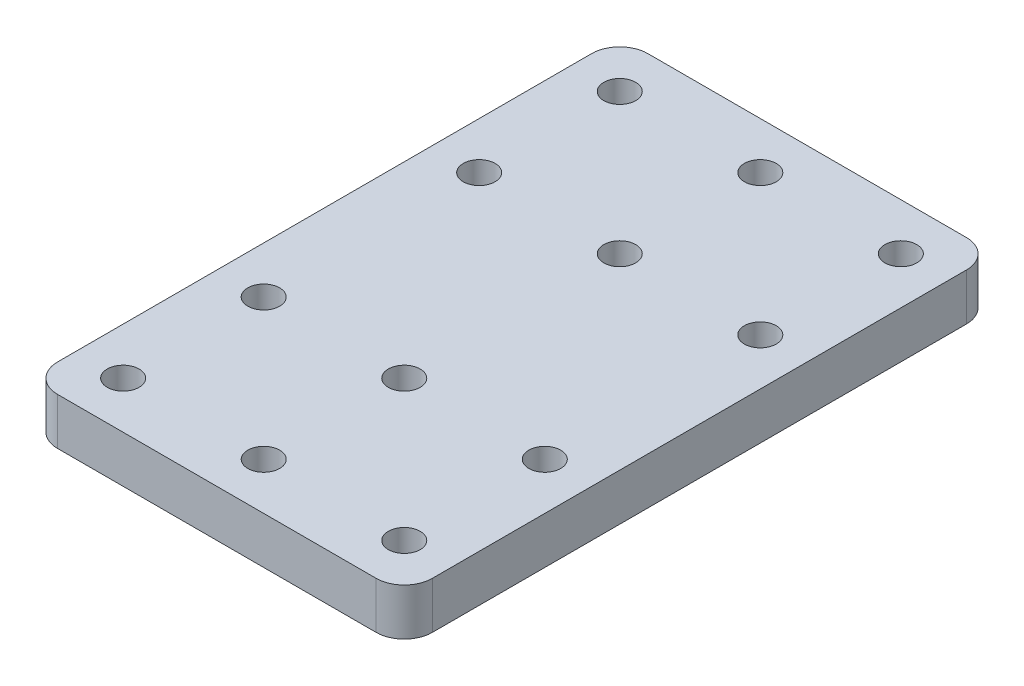
ISO-10303-21;
HEADER;
FILE_DESCRIPTION(('STEP AP214'),'2;1');
FILE_NAME('part.step','',(''),(''),'','','');
FILE_SCHEMA(('AUTOMOTIVE_DESIGN { 1 0 10303 214 1 1 1 1 }'));
ENDSEC;
DATA;
#1=APPLICATION_CONTEXT('core data for automotive mechanical design processes');
#2=APPLICATION_PROTOCOL_DEFINITION('international standard','automotive_design',2000,#1);
#3=PRODUCT_CONTEXT('',#1,'mechanical');
#4=PRODUCT('Part','Part','',(#3));
#5=PRODUCT_RELATED_PRODUCT_CATEGORY('part','',(#4));
#6=PRODUCT_DEFINITION_FORMATION('','',#4);
#7=PRODUCT_DEFINITION_CONTEXT('part definition',#1,'design');
#8=PRODUCT_DEFINITION('design','',#6,#7);
#9=PRODUCT_DEFINITION_SHAPE('','',#8);
#10=(LENGTH_UNIT() NAMED_UNIT(*) SI_UNIT(.MILLI.,.METRE.));
#11=(NAMED_UNIT(*) PLANE_ANGLE_UNIT() SI_UNIT($,.RADIAN.));
#12=(NAMED_UNIT(*) SI_UNIT($,.STERADIAN.) SOLID_ANGLE_UNIT());
#13=UNCERTAINTY_MEASURE_WITH_UNIT(LENGTH_MEASURE(1.E-05),#10,'distance_accuracy_value','');
#14=(GEOMETRIC_REPRESENTATION_CONTEXT(3) GLOBAL_UNCERTAINTY_ASSIGNED_CONTEXT((#13)) GLOBAL_UNIT_ASSIGNED_CONTEXT((#10,
#11,#12)) REPRESENTATION_CONTEXT('',''));
#15=CARTESIAN_POINT('',(0.,0.,0.));
#16=DIRECTION('',(0.,0.,1.));
#17=DIRECTION('',(1.,0.,0.));
#18=AXIS2_PLACEMENT_3D('',#15,#16,#17);
#19=CARTESIAN_POINT('',(0.,5.,0.));
#20=DIRECTION('',(0.,1.,0.));
#21=DIRECTION('',(0.,0.,1.));
#22=AXIS2_PLACEMENT_3D('',#19,#20,#21);
#23=PLANE('',#22);
#24=CARTESIAN_POINT('',(5.49682997800478E-13,5.,26.5));
#25=DIRECTION('',(0.,1.,0.));
#26=DIRECTION('',(0.,0.,1.));
#27=AXIS2_PLACEMENT_3D('',#24,#25,#26);
#28=CIRCLE('',#27,1.7);
#29=CARTESIAN_POINT('',(5.49682997800478E-13,5.,28.2));
#30=VERTEX_POINT('',#29);
#31=EDGE_CURVE('E234',#30,#30,#28,.T.);
#32=ORIENTED_EDGE('',*,*,#31,.F.);
#33=EDGE_LOOP('',(#32));
#34=FACE_BOUND('',#33,.T.);
#35=CARTESIAN_POINT('',(15.0000000000004,5.,11.5));
#36=DIRECTION('',(0.,1.,0.));
#37=DIRECTION('',(0.,0.,1.));
#38=AXIS2_PLACEMENT_3D('',#35,#36,#37);
#39=CIRCLE('',#38,1.7);
#40=CARTESIAN_POINT('',(15.0000000000004,5.,13.2));
#41=VERTEX_POINT('',#40);
#42=EDGE_CURVE('E222',#41,#41,#39,.T.);
#43=ORIENTED_EDGE('',*,*,#42,.F.);
#44=EDGE_LOOP('',(#43));
#45=FACE_BOUND('',#44,.T.);
#46=CARTESIAN_POINT('',(-14.9999999999996,5.,11.5));
#47=DIRECTION('',(0.,1.,0.));
#48=DIRECTION('',(0.,0.,1.));
#49=AXIS2_PLACEMENT_3D('',#46,#47,#48);
#50=CIRCLE('',#49,1.7);
#51=CARTESIAN_POINT('',(-14.9999999999996,5.,13.2));
#52=VERTEX_POINT('',#51);
#53=EDGE_CURVE('E210',#52,#52,#50,.T.);
#54=ORIENTED_EDGE('',*,*,#53,.F.);
#55=EDGE_LOOP('',(#54));
#56=FACE_BOUND('',#55,.T.);
#57=CARTESIAN_POINT('',(1.53980954090741E-13,5.,-11.5));
#58=DIRECTION('',(0.,1.,0.));
#59=DIRECTION('',(0.,0.,1.));
#60=AXIS2_PLACEMENT_3D('',#57,#58,#59);
#61=CIRCLE('',#60,1.7);
#62=CARTESIAN_POINT('',(1.53980954090741E-13,5.,-9.8));
#63=VERTEX_POINT('',#62);
#64=EDGE_CURVE('E198',#63,#63,#61,.T.);
#65=ORIENTED_EDGE('',*,*,#64,.F.);
#66=EDGE_LOOP('',(#65));
#67=FACE_BOUND('',#66,.T.);
#68=CARTESIAN_POINT('',(15.,5.,-26.5));
#69=DIRECTION('',(0.,1.,0.));
#70=DIRECTION('',(0.,0.,1.));
#71=AXIS2_PLACEMENT_3D('',#68,#69,#70);
#72=CIRCLE('',#71,1.7);
#73=CARTESIAN_POINT('',(15.,5.,-24.8));
#74=VERTEX_POINT('',#73);
#75=EDGE_CURVE('E186',#74,#74,#72,.T.);
#76=ORIENTED_EDGE('',*,*,#75,.F.);
#77=EDGE_LOOP('',(#76));
#78=FACE_BOUND('',#77,.T.);
#79=CARTESIAN_POINT('',(-15.,5.,-26.5));
#80=DIRECTION('',(0.,1.,0.));
#81=DIRECTION('',(0.,0.,1.));
#82=AXIS2_PLACEMENT_3D('',#79,#80,#81);
#83=CIRCLE('',#82,1.7);
#84=CARTESIAN_POINT('',(-15.,5.,-24.8));
#85=VERTEX_POINT('',#84);
#86=EDGE_CURVE('E127',#85,#85,#83,.T.);
#87=ORIENTED_EDGE('',*,*,#86,.F.);
#88=EDGE_LOOP('',(#87));
#89=FACE_BOUND('',#88,.T.);
#90=DIRECTION('',(1.,0.,0.));
#91=VECTOR('',#90,1.);
#92=CARTESIAN_POINT('',(-20.,5.,31.5));
#93=LINE('',#92,#91);
#94=CARTESIAN_POINT('',(-17.,5.,31.5));
#95=VERTEX_POINT('',#94);
#96=CARTESIAN_POINT('',(17.,5.,31.5));
#97=VERTEX_POINT('',#96);
#98=EDGE_CURVE('E136',#95,#97,#93,.T.);
#99=ORIENTED_EDGE('',*,*,#98,.T.);
#100=CARTESIAN_POINT('',(17.,5.,28.5));
#101=DIRECTION('',(0.,1.,0.));
#102=DIRECTION('',(0.,0.,1.));
#103=AXIS2_PLACEMENT_3D('',#100,#101,#102);
#104=CIRCLE('',#103,3.);
#105=CARTESIAN_POINT('',(20.,5.,28.5));
#106=VERTEX_POINT('',#105);
#107=EDGE_CURVE('E155',#97,#106,#104,.T.);
#108=ORIENTED_EDGE('',*,*,#107,.T.);
#109=DIRECTION('',(0.,0.,-1.));
#110=VECTOR('',#109,1.);
#111=CARTESIAN_POINT('',(20.,5.,-31.5));
#112=LINE('',#111,#110);
#113=CARTESIAN_POINT('',(20.,5.,-28.5));
#114=VERTEX_POINT('',#113);
#115=EDGE_CURVE('E119',#106,#114,#112,.T.);
#116=ORIENTED_EDGE('',*,*,#115,.T.);
#117=CARTESIAN_POINT('',(17.,5.,-28.5));
#118=DIRECTION('',(0.,1.,0.));
#119=DIRECTION('',(0.,0.,1.));
#120=AXIS2_PLACEMENT_3D('',#117,#118,#119);
#121=CIRCLE('',#120,3.);
#122=CARTESIAN_POINT('',(17.,5.,-31.5));
#123=VERTEX_POINT('',#122);
#124=EDGE_CURVE('E150',#114,#123,#121,.T.);
#125=ORIENTED_EDGE('',*,*,#124,.T.);
#126=DIRECTION('',(-1.,0.,0.));
#127=VECTOR('',#126,1.);
#128=CARTESIAN_POINT('',(-20.,5.,-31.5));
#129=LINE('',#128,#127);
#130=CARTESIAN_POINT('',(-17.,5.,-31.5));
#131=VERTEX_POINT('',#130);
#132=EDGE_CURVE('E166',#123,#131,#129,.T.);
#133=ORIENTED_EDGE('',*,*,#132,.T.);
#134=CARTESIAN_POINT('',(-17.,5.,-28.5));
#135=DIRECTION('',(0.,1.,0.));
#136=DIRECTION('',(0.,0.,1.));
#137=AXIS2_PLACEMENT_3D('',#134,#135,#136);
#138=CIRCLE('',#137,3.);
#139=CARTESIAN_POINT('',(-20.,5.,-28.5));
#140=VERTEX_POINT('',#139);
#141=EDGE_CURVE('E55',#131,#140,#138,.T.);
#142=ORIENTED_EDGE('',*,*,#141,.T.);
#143=DIRECTION('',(0.,0.,1.));
#144=VECTOR('',#143,1.);
#145=CARTESIAN_POINT('',(-20.,5.,-31.5));
#146=LINE('',#145,#144);
#147=CARTESIAN_POINT('',(-20.,5.,28.5));
#148=VERTEX_POINT('',#147);
#149=EDGE_CURVE('E174',#140,#148,#146,.T.);
#150=ORIENTED_EDGE('',*,*,#149,.T.);
#151=CARTESIAN_POINT('',(-17.,5.,28.5));
#152=DIRECTION('',(0.,1.,0.));
#153=DIRECTION('',(0.,0.,1.));
#154=AXIS2_PLACEMENT_3D('',#151,#152,#153);
#155=CIRCLE('',#154,3.);
#156=EDGE_CURVE('E153',#148,#95,#155,.T.);
#157=ORIENTED_EDGE('',*,*,#156,.T.);
#158=EDGE_LOOP('',(#99,#108,#116,#125,#133,#142,#150,#157));
#159=FACE_BOUND('',#158,.T.);
#160=CARTESIAN_POINT('',(0.,5.,-26.5));
#161=DIRECTION('',(0.,1.,0.));
#162=DIRECTION('',(0.,0.,1.));
#163=AXIS2_PLACEMENT_3D('',#160,#161,#162);
#164=CIRCLE('',#163,1.7);
#165=CARTESIAN_POINT('',(0.,5.,-24.8));
#166=VERTEX_POINT('',#165);
#167=EDGE_CURVE('E181',#166,#166,#164,.T.);
#168=ORIENTED_EDGE('',*,*,#167,.F.);
#169=EDGE_LOOP('',(#168));
#170=FACE_BOUND('',#169,.T.);
#171=CARTESIAN_POINT('',(-14.9999999999998,5.,-11.5));
#172=DIRECTION('',(0.,1.,0.));
#173=DIRECTION('',(0.,0.,1.));
#174=AXIS2_PLACEMENT_3D('',#171,#172,#173);
#175=CIRCLE('',#174,1.7);
#176=CARTESIAN_POINT('',(-14.9999999999998,5.,-9.8));
#177=VERTEX_POINT('',#176);
#178=EDGE_CURVE('E192',#177,#177,#175,.T.);
#179=ORIENTED_EDGE('',*,*,#178,.F.);
#180=EDGE_LOOP('',(#179));
#181=FACE_BOUND('',#180,.T.);
#182=CARTESIAN_POINT('',(15.0000000000002,5.,-11.5));
#183=DIRECTION('',(0.,1.,0.));
#184=DIRECTION('',(0.,0.,1.));
#185=AXIS2_PLACEMENT_3D('',#182,#183,#184);
#186=CIRCLE('',#185,1.7);
#187=CARTESIAN_POINT('',(15.0000000000002,5.,-9.8));
#188=VERTEX_POINT('',#187);
#189=EDGE_CURVE('E204',#188,#188,#186,.T.);
#190=ORIENTED_EDGE('',*,*,#189,.F.);
#191=EDGE_LOOP('',(#190));
#192=FACE_BOUND('',#191,.T.);
#193=CARTESIAN_POINT('',(3.93484822651898E-13,5.,11.5));
#194=DIRECTION('',(0.,1.,0.));
#195=DIRECTION('',(0.,0.,1.));
#196=AXIS2_PLACEMENT_3D('',#193,#194,#195);
#197=CIRCLE('',#196,1.7);
#198=CARTESIAN_POINT('',(3.93484822651898E-13,5.,13.2));
#199=VERTEX_POINT('',#198);
#200=EDGE_CURVE('E216',#199,#199,#197,.T.);
#201=ORIENTED_EDGE('',*,*,#200,.F.);
#202=EDGE_LOOP('',(#201));
#203=FACE_BOUND('',#202,.T.);
#204=CARTESIAN_POINT('',(-14.9999999999994,5.,26.5));
#205=DIRECTION('',(0.,1.,0.));
#206=DIRECTION('',(0.,0.,1.));
#207=AXIS2_PLACEMENT_3D('',#204,#205,#206);
#208=CIRCLE('',#207,1.7);
#209=CARTESIAN_POINT('',(-14.9999999999994,5.,28.2));
#210=VERTEX_POINT('',#209);
#211=EDGE_CURVE('E228',#210,#210,#208,.T.);
#212=ORIENTED_EDGE('',*,*,#211,.F.);
#213=EDGE_LOOP('',(#212));
#214=FACE_BOUND('',#213,.T.);
#215=CARTESIAN_POINT('',(15.0000000000006,5.,26.5));
#216=DIRECTION('',(0.,1.,0.));
#217=DIRECTION('',(0.,0.,1.));
#218=AXIS2_PLACEMENT_3D('',#215,#216,#217);
#219=CIRCLE('',#218,1.7);
#220=CARTESIAN_POINT('',(15.0000000000006,5.,28.2));
#221=VERTEX_POINT('',#220);
#222=EDGE_CURVE('E240',#221,#221,#219,.T.);
#223=ORIENTED_EDGE('',*,*,#222,.F.);
#224=EDGE_LOOP('',(#223));
#225=FACE_BOUND('',#224,.T.);
#226=ADVANCED_FACE('F33',(#34,#45,#56,#67,#78,#89,#159,#170,#181,#192,#203,#214,#225),#23,.T.);
#227=CARTESIAN_POINT('',(0.,0.,0.));
#228=DIRECTION('',(0.,1.,0.));
#229=DIRECTION('',(0.,0.,1.));
#230=AXIS2_PLACEMENT_3D('',#227,#228,#229);
#231=PLANE('',#230);
#232=DIRECTION('',(0.,0.,-1.));
#233=VECTOR('',#232,1.);
#234=CARTESIAN_POINT('',(20.,0.,-31.5));
#235=LINE('',#234,#233);
#236=CARTESIAN_POINT('',(20.,0.,28.5));
#237=VERTEX_POINT('',#236);
#238=CARTESIAN_POINT('',(20.,0.,-28.5));
#239=VERTEX_POINT('',#238);
#240=EDGE_CURVE('E116',#237,#239,#235,.T.);
#241=ORIENTED_EDGE('',*,*,#240,.F.);
#242=CARTESIAN_POINT('',(17.,0.,28.5));
#243=DIRECTION('',(0.,1.,0.));
#244=DIRECTION('',(0.,0.,1.));
#245=AXIS2_PLACEMENT_3D('',#242,#243,#244);
#246=CIRCLE('',#245,3.);
#247=CARTESIAN_POINT('',(17.,0.,31.5));
#248=VERTEX_POINT('',#247);
#249=EDGE_CURVE('E99',#237,#248,#246,.F.);
#250=ORIENTED_EDGE('',*,*,#249,.T.);
#251=DIRECTION('',(1.,0.,0.));
#252=VECTOR('',#251,1.);
#253=CARTESIAN_POINT('',(-20.,0.,31.5));
#254=LINE('',#253,#252);
#255=CARTESIAN_POINT('',(-17.,0.,31.5));
#256=VERTEX_POINT('',#255);
#257=EDGE_CURVE('E140',#256,#248,#254,.T.);
#258=ORIENTED_EDGE('',*,*,#257,.F.);
#259=CARTESIAN_POINT('',(-17.,0.,28.5));
#260=DIRECTION('',(0.,1.,0.));
#261=DIRECTION('',(0.,0.,1.));
#262=AXIS2_PLACEMENT_3D('',#259,#260,#261);
#263=CIRCLE('',#262,3.);
#264=CARTESIAN_POINT('',(-20.,0.,28.5));
#265=VERTEX_POINT('',#264);
#266=EDGE_CURVE('E110',#256,#265,#263,.F.);
#267=ORIENTED_EDGE('',*,*,#266,.T.);
#268=DIRECTION('',(0.,0.,1.));
#269=VECTOR('',#268,1.);
#270=CARTESIAN_POINT('',(-20.,0.,-31.5));
#271=LINE('',#270,#269);
#272=CARTESIAN_POINT('',(-20.,0.,-28.5));
#273=VERTEX_POINT('',#272);
#274=EDGE_CURVE('E130',#273,#265,#271,.T.);
#275=ORIENTED_EDGE('',*,*,#274,.F.);
#276=CARTESIAN_POINT('',(-17.,0.,-28.5));
#277=DIRECTION('',(0.,1.,0.));
#278=DIRECTION('',(0.,0.,1.));
#279=AXIS2_PLACEMENT_3D('',#276,#277,#278);
#280=CIRCLE('',#279,3.);
#281=CARTESIAN_POINT('',(-17.,0.,-31.5));
#282=VERTEX_POINT('',#281);
#283=EDGE_CURVE('E144',#273,#282,#280,.F.);
#284=ORIENTED_EDGE('',*,*,#283,.T.);
#285=DIRECTION('',(-1.,0.,0.));
#286=VECTOR('',#285,1.);
#287=CARTESIAN_POINT('',(-20.,0.,-31.5));
#288=LINE('',#287,#286);
#289=CARTESIAN_POINT('',(17.,0.,-31.5));
#290=VERTEX_POINT('',#289);
#291=EDGE_CURVE('E126',#290,#282,#288,.T.);
#292=ORIENTED_EDGE('',*,*,#291,.F.);
#293=CARTESIAN_POINT('',(17.,0.,-28.5));
#294=DIRECTION('',(0.,1.,0.));
#295=DIRECTION('',(0.,0.,1.));
#296=AXIS2_PLACEMENT_3D('',#293,#294,#295);
#297=CIRCLE('',#296,3.);
#298=EDGE_CURVE('E120',#290,#239,#297,.F.);
#299=ORIENTED_EDGE('',*,*,#298,.T.);
#300=EDGE_LOOP('',(#241,#250,#258,#267,#275,#284,#292,#299));
#301=FACE_BOUND('',#300,.T.);
#302=CARTESIAN_POINT('',(-15.,0.,-26.5));
#303=DIRECTION('',(0.,1.,0.));
#304=DIRECTION('',(0.,0.,1.));
#305=AXIS2_PLACEMENT_3D('',#302,#303,#304);
#306=CIRCLE('',#305,1.7);
#307=CARTESIAN_POINT('',(-15.,0.,-24.8));
#308=VERTEX_POINT('',#307);
#309=EDGE_CURVE('E133',#308,#308,#306,.T.);
#310=ORIENTED_EDGE('',*,*,#309,.T.);
#311=EDGE_LOOP('',(#310));
#312=FACE_BOUND('',#311,.T.);
#313=CARTESIAN_POINT('',(0.,0.,-26.5));
#314=DIRECTION('',(0.,1.,0.));
#315=DIRECTION('',(0.,0.,1.));
#316=AXIS2_PLACEMENT_3D('',#313,#314,#315);
#317=CIRCLE('',#316,1.7);
#318=CARTESIAN_POINT('',(0.,0.,-24.8));
#319=VERTEX_POINT('',#318);
#320=EDGE_CURVE('E183',#319,#319,#317,.T.);
#321=ORIENTED_EDGE('',*,*,#320,.T.);
#322=EDGE_LOOP('',(#321));
#323=FACE_BOUND('',#322,.T.);
#324=CARTESIAN_POINT('',(15.,0.,-26.5));
#325=DIRECTION('',(0.,1.,0.));
#326=DIRECTION('',(0.,0.,1.));
#327=AXIS2_PLACEMENT_3D('',#324,#325,#326);
#328=CIRCLE('',#327,1.7);
#329=CARTESIAN_POINT('',(15.,0.,-24.8));
#330=VERTEX_POINT('',#329);
#331=EDGE_CURVE('E189',#330,#330,#328,.T.);
#332=ORIENTED_EDGE('',*,*,#331,.T.);
#333=EDGE_LOOP('',(#332));
#334=FACE_BOUND('',#333,.T.);
#335=CARTESIAN_POINT('',(-14.9999999999998,0.,-11.5));
#336=DIRECTION('',(0.,1.,0.));
#337=DIRECTION('',(0.,0.,1.));
#338=AXIS2_PLACEMENT_3D('',#335,#336,#337);
#339=CIRCLE('',#338,1.7);
#340=CARTESIAN_POINT('',(-14.9999999999998,0.,-9.8));
#341=VERTEX_POINT('',#340);
#342=EDGE_CURVE('E195',#341,#341,#339,.T.);
#343=ORIENTED_EDGE('',*,*,#342,.T.);
#344=EDGE_LOOP('',(#343));
#345=FACE_BOUND('',#344,.T.);
#346=CARTESIAN_POINT('',(1.53980954090741E-13,0.,-11.5));
#347=DIRECTION('',(0.,1.,0.));
#348=DIRECTION('',(0.,0.,1.));
#349=AXIS2_PLACEMENT_3D('',#346,#347,#348);
#350=CIRCLE('',#349,1.7);
#351=CARTESIAN_POINT('',(1.53980954090741E-13,0.,-9.8));
#352=VERTEX_POINT('',#351);
#353=EDGE_CURVE('E201',#352,#352,#350,.T.);
#354=ORIENTED_EDGE('',*,*,#353,.T.);
#355=EDGE_LOOP('',(#354));
#356=FACE_BOUND('',#355,.T.);
#357=CARTESIAN_POINT('',(15.0000000000002,0.,-11.5));
#358=DIRECTION('',(0.,1.,0.));
#359=DIRECTION('',(0.,0.,1.));
#360=AXIS2_PLACEMENT_3D('',#357,#358,#359);
#361=CIRCLE('',#360,1.7);
#362=CARTESIAN_POINT('',(15.0000000000002,0.,-9.8));
#363=VERTEX_POINT('',#362);
#364=EDGE_CURVE('E207',#363,#363,#361,.T.);
#365=ORIENTED_EDGE('',*,*,#364,.T.);
#366=EDGE_LOOP('',(#365));
#367=FACE_BOUND('',#366,.T.);
#368=CARTESIAN_POINT('',(-14.9999999999996,0.,11.5));
#369=DIRECTION('',(0.,1.,0.));
#370=DIRECTION('',(0.,0.,1.));
#371=AXIS2_PLACEMENT_3D('',#368,#369,#370);
#372=CIRCLE('',#371,1.7);
#373=CARTESIAN_POINT('',(-14.9999999999996,0.,13.2));
#374=VERTEX_POINT('',#373);
#375=EDGE_CURVE('E213',#374,#374,#372,.T.);
#376=ORIENTED_EDGE('',*,*,#375,.T.);
#377=EDGE_LOOP('',(#376));
#378=FACE_BOUND('',#377,.T.);
#379=CARTESIAN_POINT('',(3.93484822651898E-13,0.,11.5));
#380=DIRECTION('',(0.,1.,0.));
#381=DIRECTION('',(0.,0.,1.));
#382=AXIS2_PLACEMENT_3D('',#379,#380,#381);
#383=CIRCLE('',#382,1.7);
#384=CARTESIAN_POINT('',(3.93484822651898E-13,0.,13.2));
#385=VERTEX_POINT('',#384);
#386=EDGE_CURVE('E219',#385,#385,#383,.T.);
#387=ORIENTED_EDGE('',*,*,#386,.T.);
#388=EDGE_LOOP('',(#387));
#389=FACE_BOUND('',#388,.T.);
#390=CARTESIAN_POINT('',(15.0000000000004,0.,11.5));
#391=DIRECTION('',(0.,1.,0.));
#392=DIRECTION('',(0.,0.,1.));
#393=AXIS2_PLACEMENT_3D('',#390,#391,#392);
#394=CIRCLE('',#393,1.7);
#395=CARTESIAN_POINT('',(15.0000000000004,0.,13.2));
#396=VERTEX_POINT('',#395);
#397=EDGE_CURVE('E225',#396,#396,#394,.T.);
#398=ORIENTED_EDGE('',*,*,#397,.T.);
#399=EDGE_LOOP('',(#398));
#400=FACE_BOUND('',#399,.T.);
#401=CARTESIAN_POINT('',(-14.9999999999994,0.,26.5));
#402=DIRECTION('',(0.,1.,0.));
#403=DIRECTION('',(0.,0.,1.));
#404=AXIS2_PLACEMENT_3D('',#401,#402,#403);
#405=CIRCLE('',#404,1.7);
#406=CARTESIAN_POINT('',(-14.9999999999994,0.,28.2));
#407=VERTEX_POINT('',#406);
#408=EDGE_CURVE('E231',#407,#407,#405,.T.);
#409=ORIENTED_EDGE('',*,*,#408,.T.);
#410=EDGE_LOOP('',(#409));
#411=FACE_BOUND('',#410,.T.);
#412=CARTESIAN_POINT('',(5.49682997800478E-13,0.,26.5));
#413=DIRECTION('',(0.,1.,0.));
#414=DIRECTION('',(0.,0.,1.));
#415=AXIS2_PLACEMENT_3D('',#412,#413,#414);
#416=CIRCLE('',#415,1.7);
#417=CARTESIAN_POINT('',(5.49682997800478E-13,0.,28.2));
#418=VERTEX_POINT('',#417);
#419=EDGE_CURVE('E237',#418,#418,#416,.T.);
#420=ORIENTED_EDGE('',*,*,#419,.T.);
#421=EDGE_LOOP('',(#420));
#422=FACE_BOUND('',#421,.T.);
#423=CARTESIAN_POINT('',(15.0000000000006,0.,26.5));
#424=DIRECTION('',(0.,1.,0.));
#425=DIRECTION('',(0.,0.,1.));
#426=AXIS2_PLACEMENT_3D('',#423,#424,#425);
#427=CIRCLE('',#426,1.7);
#428=CARTESIAN_POINT('',(15.0000000000006,0.,28.2));
#429=VERTEX_POINT('',#428);
#430=EDGE_CURVE('E243',#429,#429,#427,.T.);
#431=ORIENTED_EDGE('',*,*,#430,.T.);
#432=EDGE_LOOP('',(#431));
#433=FACE_BOUND('',#432,.T.);
#434=ADVANCED_FACE('F123',(#301,#312,#323,#334,#345,#356,#367,#378,#389,#400,#411,#422,#433),
#231,.F.);
#435=CARTESIAN_POINT('',(20.,5.,-31.5));
#436=DIRECTION('',(-1.,0.,0.));
#437=DIRECTION('',(0.,0.,1.));
#438=AXIS2_PLACEMENT_3D('',#435,#436,#437);
#439=PLANE('',#438);
#440=ORIENTED_EDGE('',*,*,#115,.F.);
#441=DIRECTION('',(0.,-1.,0.));
#442=VECTOR('',#441,1.);
#443=CARTESIAN_POINT('',(20.,5.,28.5));
#444=LINE('',#443,#442);
#445=EDGE_CURVE('E103',#106,#237,#444,.T.);
#446=ORIENTED_EDGE('',*,*,#445,.T.);
#447=ORIENTED_EDGE('',*,*,#240,.T.);
#448=DIRECTION('',(0.,-1.,0.));
#449=VECTOR('',#448,1.);
#450=CARTESIAN_POINT('',(20.,5.,-28.5));
#451=LINE('',#450,#449);
#452=EDGE_CURVE('E121',#239,#114,#451,.F.);
#453=ORIENTED_EDGE('',*,*,#452,.T.);
#454=EDGE_LOOP('',(#440,#446,#447,#453));
#455=FACE_BOUND('',#454,.T.);
#456=ADVANCED_FACE('F115',(#455),#439,.F.);
#457=CARTESIAN_POINT('',(-20.,5.,-31.5));
#458=DIRECTION('',(0.,0.,1.));
#459=DIRECTION('',(1.,0.,0.));
#460=AXIS2_PLACEMENT_3D('',#457,#458,#459);
#461=PLANE('',#460);
#462=ORIENTED_EDGE('',*,*,#291,.T.);
#463=DIRECTION('',(0.,-1.,0.));
#464=VECTOR('',#463,1.);
#465=CARTESIAN_POINT('',(-17.,5.,-31.5));
#466=LINE('',#465,#464);
#467=EDGE_CURVE('E11',#282,#131,#466,.F.);
#468=ORIENTED_EDGE('',*,*,#467,.T.);
#469=ORIENTED_EDGE('',*,*,#132,.F.);
#470=DIRECTION('',(0.,-1.,0.));
#471=VECTOR('',#470,1.);
#472=CARTESIAN_POINT('',(17.,5.,-31.5));
#473=LINE('',#472,#471);
#474=EDGE_CURVE('E41',#123,#290,#473,.T.);
#475=ORIENTED_EDGE('',*,*,#474,.T.);
#476=EDGE_LOOP('',(#462,#468,#469,#475));
#477=FACE_BOUND('',#476,.T.);
#478=ADVANCED_FACE('F164',(#477),#461,.F.);
#479=CARTESIAN_POINT('',(-20.,5.,-31.5));
#480=DIRECTION('',(1.,0.,0.));
#481=DIRECTION('',(0.,0.,-1.));
#482=AXIS2_PLACEMENT_3D('',#479,#480,#481);
#483=PLANE('',#482);
#484=ORIENTED_EDGE('',*,*,#274,.T.);
#485=DIRECTION('',(0.,-1.,0.));
#486=VECTOR('',#485,1.);
#487=CARTESIAN_POINT('',(-20.,5.,28.5));
#488=LINE('',#487,#486);
#489=EDGE_CURVE('E48',#265,#148,#488,.F.);
#490=ORIENTED_EDGE('',*,*,#489,.T.);
#491=ORIENTED_EDGE('',*,*,#149,.F.);
#492=DIRECTION('',(0.,-1.,0.));
#493=VECTOR('',#492,1.);
#494=CARTESIAN_POINT('',(-20.,5.,-28.5));
#495=LINE('',#494,#493);
#496=EDGE_CURVE('E157',#140,#273,#495,.T.);
#497=ORIENTED_EDGE('',*,*,#496,.T.);
#498=EDGE_LOOP('',(#484,#490,#491,#497));
#499=FACE_BOUND('',#498,.T.);
#500=ADVANCED_FACE('F173',(#499),#483,.F.);
#501=CARTESIAN_POINT('',(-20.,5.,31.5));
#502=DIRECTION('',(0.,0.,-1.));
#503=DIRECTION('',(-1.,0.,0.));
#504=AXIS2_PLACEMENT_3D('',#501,#502,#503);
#505=PLANE('',#504);
#506=ORIENTED_EDGE('',*,*,#257,.T.);
#507=DIRECTION('',(0.,-1.,0.));
#508=VECTOR('',#507,1.);
#509=CARTESIAN_POINT('',(17.,5.,31.5));
#510=LINE('',#509,#508);
#511=EDGE_CURVE('E104',#248,#97,#510,.F.);
#512=ORIENTED_EDGE('',*,*,#511,.T.);
#513=ORIENTED_EDGE('',*,*,#98,.F.);
#514=DIRECTION('',(0.,-1.,0.));
#515=VECTOR('',#514,1.);
#516=CARTESIAN_POINT('',(-17.,5.,31.5));
#517=LINE('',#516,#515);
#518=EDGE_CURVE('E109',#95,#256,#517,.T.);
#519=ORIENTED_EDGE('',*,*,#518,.T.);
#520=EDGE_LOOP('',(#506,#512,#513,#519));
#521=FACE_BOUND('',#520,.T.);
#522=ADVANCED_FACE('F265',(#521),#505,.F.);
#523=CARTESIAN_POINT('',(-15.,5.,-26.5));
#524=DIRECTION('',(0.,-1.,0.));
#525=DIRECTION('',(0.,0.,-1.));
#526=AXIS2_PLACEMENT_3D('',#523,#524,#525);
#527=CYLINDRICAL_SURFACE('',#526,1.7);
#528=ORIENTED_EDGE('',*,*,#86,.T.);
#529=EDGE_LOOP('',(#528));
#530=FACE_BOUND('',#529,.T.);
#531=ORIENTED_EDGE('',*,*,#309,.F.);
#532=EDGE_LOOP('',(#531));
#533=FACE_BOUND('',#532,.T.);
#534=ADVANCED_FACE('F262',(#530,#533),#527,.F.);
#535=CARTESIAN_POINT('',(0.,5.,-26.5));
#536=DIRECTION('',(0.,-1.,0.));
#537=DIRECTION('',(0.,0.,-1.));
#538=AXIS2_PLACEMENT_3D('',#535,#536,#537);
#539=CYLINDRICAL_SURFACE('',#538,1.7);
#540=ORIENTED_EDGE('',*,*,#167,.T.);
#541=EDGE_LOOP('',(#540));
#542=FACE_BOUND('',#541,.T.);
#543=ORIENTED_EDGE('',*,*,#320,.F.);
#544=EDGE_LOOP('',(#543));
#545=FACE_BOUND('',#544,.T.);
#546=ADVANCED_FACE('F344',(#542,#545),#539,.F.);
#547=CARTESIAN_POINT('',(15.,5.,-26.5));
#548=DIRECTION('',(0.,-1.,0.));
#549=DIRECTION('',(0.,0.,-1.));
#550=AXIS2_PLACEMENT_3D('',#547,#548,#549);
#551=CYLINDRICAL_SURFACE('',#550,1.7);
#552=ORIENTED_EDGE('',*,*,#75,.T.);
#553=EDGE_LOOP('',(#552));
#554=FACE_BOUND('',#553,.T.);
#555=ORIENTED_EDGE('',*,*,#331,.F.);
#556=EDGE_LOOP('',(#555));
#557=FACE_BOUND('',#556,.T.);
#558=ADVANCED_FACE('F341',(#554,#557),#551,.F.);
#559=CARTESIAN_POINT('',(-14.9999999999998,5.,-11.5));
#560=DIRECTION('',(0.,-1.,0.));
#561=DIRECTION('',(0.,0.,-1.));
#562=AXIS2_PLACEMENT_3D('',#559,#560,#561);
#563=CYLINDRICAL_SURFACE('',#562,1.7);
#564=ORIENTED_EDGE('',*,*,#178,.T.);
#565=EDGE_LOOP('',(#564));
#566=FACE_BOUND('',#565,.T.);
#567=ORIENTED_EDGE('',*,*,#342,.F.);
#568=EDGE_LOOP('',(#567));
#569=FACE_BOUND('',#568,.T.);
#570=ADVANCED_FACE('F337',(#566,#569),#563,.F.);
#571=CARTESIAN_POINT('',(1.53980954090741E-13,5.,-11.5));
#572=DIRECTION('',(0.,-1.,0.));
#573=DIRECTION('',(0.,0.,-1.));
#574=AXIS2_PLACEMENT_3D('',#571,#572,#573);
#575=CYLINDRICAL_SURFACE('',#574,1.7);
#576=ORIENTED_EDGE('',*,*,#64,.T.);
#577=EDGE_LOOP('',(#576));
#578=FACE_BOUND('',#577,.T.);
#579=ORIENTED_EDGE('',*,*,#353,.F.);
#580=EDGE_LOOP('',(#579));
#581=FACE_BOUND('',#580,.T.);
#582=ADVANCED_FACE('F333',(#578,#581),#575,.F.);
#583=CARTESIAN_POINT('',(15.0000000000002,5.,-11.5));
#584=DIRECTION('',(0.,-1.,0.));
#585=DIRECTION('',(0.,0.,-1.));
#586=AXIS2_PLACEMENT_3D('',#583,#584,#585);
#587=CYLINDRICAL_SURFACE('',#586,1.7);
#588=ORIENTED_EDGE('',*,*,#189,.T.);
#589=EDGE_LOOP('',(#588));
#590=FACE_BOUND('',#589,.T.);
#591=ORIENTED_EDGE('',*,*,#364,.F.);
#592=EDGE_LOOP('',(#591));
#593=FACE_BOUND('',#592,.T.);
#594=ADVANCED_FACE('F329',(#590,#593),#587,.F.);
#595=CARTESIAN_POINT('',(-14.9999999999996,5.,11.5));
#596=DIRECTION('',(0.,-1.,0.));
#597=DIRECTION('',(0.,0.,-1.));
#598=AXIS2_PLACEMENT_3D('',#595,#596,#597);
#599=CYLINDRICAL_SURFACE('',#598,1.7);
#600=ORIENTED_EDGE('',*,*,#53,.T.);
#601=EDGE_LOOP('',(#600));
#602=FACE_BOUND('',#601,.T.);
#603=ORIENTED_EDGE('',*,*,#375,.F.);
#604=EDGE_LOOP('',(#603));
#605=FACE_BOUND('',#604,.T.);
#606=ADVANCED_FACE('F325',(#602,#605),#599,.F.);
#607=CARTESIAN_POINT('',(3.93484822651898E-13,5.,11.5));
#608=DIRECTION('',(0.,-1.,0.));
#609=DIRECTION('',(0.,0.,-1.));
#610=AXIS2_PLACEMENT_3D('',#607,#608,#609);
#611=CYLINDRICAL_SURFACE('',#610,1.7);
#612=ORIENTED_EDGE('',*,*,#200,.T.);
#613=EDGE_LOOP('',(#612));
#614=FACE_BOUND('',#613,.T.);
#615=ORIENTED_EDGE('',*,*,#386,.F.);
#616=EDGE_LOOP('',(#615));
#617=FACE_BOUND('',#616,.T.);
#618=ADVANCED_FACE('F321',(#614,#617),#611,.F.);
#619=CARTESIAN_POINT('',(15.0000000000004,5.,11.5));
#620=DIRECTION('',(0.,-1.,0.));
#621=DIRECTION('',(0.,0.,-1.));
#622=AXIS2_PLACEMENT_3D('',#619,#620,#621);
#623=CYLINDRICAL_SURFACE('',#622,1.7);
#624=ORIENTED_EDGE('',*,*,#42,.T.);
#625=EDGE_LOOP('',(#624));
#626=FACE_BOUND('',#625,.T.);
#627=ORIENTED_EDGE('',*,*,#397,.F.);
#628=EDGE_LOOP('',(#627));
#629=FACE_BOUND('',#628,.T.);
#630=ADVANCED_FACE('F303',(#626,#629),#623,.F.);
#631=CARTESIAN_POINT('',(-14.9999999999994,5.,26.5));
#632=DIRECTION('',(0.,-1.,0.));
#633=DIRECTION('',(0.,0.,-1.));
#634=AXIS2_PLACEMENT_3D('',#631,#632,#633);
#635=CYLINDRICAL_SURFACE('',#634,1.7);
#636=ORIENTED_EDGE('',*,*,#211,.T.);
#637=EDGE_LOOP('',(#636));
#638=FACE_BOUND('',#637,.T.);
#639=ORIENTED_EDGE('',*,*,#408,.F.);
#640=EDGE_LOOP('',(#639));
#641=FACE_BOUND('',#640,.T.);
#642=ADVANCED_FACE('F299',(#638,#641),#635,.F.);
#643=CARTESIAN_POINT('',(5.49682997800478E-13,5.,26.5));
#644=DIRECTION('',(0.,-1.,0.));
#645=DIRECTION('',(0.,0.,-1.));
#646=AXIS2_PLACEMENT_3D('',#643,#644,#645);
#647=CYLINDRICAL_SURFACE('',#646,1.7);
#648=ORIENTED_EDGE('',*,*,#31,.T.);
#649=EDGE_LOOP('',(#648));
#650=FACE_BOUND('',#649,.T.);
#651=ORIENTED_EDGE('',*,*,#419,.F.);
#652=EDGE_LOOP('',(#651));
#653=FACE_BOUND('',#652,.T.);
#654=ADVANCED_FACE('F302',(#650,#653),#647,.F.);
#655=CARTESIAN_POINT('',(15.0000000000006,5.,26.5));
#656=DIRECTION('',(0.,-1.,0.));
#657=DIRECTION('',(0.,0.,-1.));
#658=AXIS2_PLACEMENT_3D('',#655,#656,#657);
#659=CYLINDRICAL_SURFACE('',#658,1.7);
#660=ORIENTED_EDGE('',*,*,#222,.T.);
#661=EDGE_LOOP('',(#660));
#662=FACE_BOUND('',#661,.T.);
#663=ORIENTED_EDGE('',*,*,#430,.F.);
#664=EDGE_LOOP('',(#663));
#665=FACE_BOUND('',#664,.T.);
#666=ADVANCED_FACE('F249',(#662,#665),#659,.F.);
#667=CARTESIAN_POINT('',(17.,5.,28.5));
#668=DIRECTION('',(0.,-1.,0.));
#669=DIRECTION('',(0.,0.,-1.));
#670=AXIS2_PLACEMENT_3D('',#667,#668,#669);
#671=CYLINDRICAL_SURFACE('',#670,3.);
#672=ORIENTED_EDGE('',*,*,#107,.F.);
#673=ORIENTED_EDGE('',*,*,#511,.F.);
#674=ORIENTED_EDGE('',*,*,#249,.F.);
#675=ORIENTED_EDGE('',*,*,#445,.F.);
#676=EDGE_LOOP('',(#672,#673,#674,#675));
#677=FACE_BOUND('',#676,.T.);
#678=ADVANCED_FACE('F102',(#677),#671,.T.);
#679=CARTESIAN_POINT('',(-17.,5.,28.5));
#680=DIRECTION('',(0.,-1.,0.));
#681=DIRECTION('',(0.,0.,-1.));
#682=AXIS2_PLACEMENT_3D('',#679,#680,#681);
#683=CYLINDRICAL_SURFACE('',#682,3.);
#684=ORIENTED_EDGE('',*,*,#156,.F.);
#685=ORIENTED_EDGE('',*,*,#489,.F.);
#686=ORIENTED_EDGE('',*,*,#266,.F.);
#687=ORIENTED_EDGE('',*,*,#518,.F.);
#688=EDGE_LOOP('',(#684,#685,#686,#687));
#689=FACE_BOUND('',#688,.T.);
#690=ADVANCED_FACE('F277',(#689),#683,.T.);
#691=CARTESIAN_POINT('',(-17.,5.,-28.5));
#692=DIRECTION('',(0.,-1.,0.));
#693=DIRECTION('',(0.,0.,-1.));
#694=AXIS2_PLACEMENT_3D('',#691,#692,#693);
#695=CYLINDRICAL_SURFACE('',#694,3.);
#696=ORIENTED_EDGE('',*,*,#141,.F.);
#697=ORIENTED_EDGE('',*,*,#467,.F.);
#698=ORIENTED_EDGE('',*,*,#283,.F.);
#699=ORIENTED_EDGE('',*,*,#496,.F.);
#700=EDGE_LOOP('',(#696,#697,#698,#699));
#701=FACE_BOUND('',#700,.T.);
#702=ADVANCED_FACE('F172',(#701),#695,.T.);
#703=CARTESIAN_POINT('',(17.,5.,-28.5));
#704=DIRECTION('',(0.,-1.,0.));
#705=DIRECTION('',(0.,0.,-1.));
#706=AXIS2_PLACEMENT_3D('',#703,#704,#705);
#707=CYLINDRICAL_SURFACE('',#706,3.);
#708=ORIENTED_EDGE('',*,*,#124,.F.);
#709=ORIENTED_EDGE('',*,*,#452,.F.);
#710=ORIENTED_EDGE('',*,*,#298,.F.);
#711=ORIENTED_EDGE('',*,*,#474,.F.);
#712=EDGE_LOOP('',(#708,#709,#710,#711));
#713=FACE_BOUND('',#712,.T.);
#714=ADVANCED_FACE('F35',(#713),#707,.T.);
#715=CLOSED_SHELL('',(#226,#434,#456,#478,#500,#522,#534,#546,#558,#570,#582,#594,#606,#618,
#630,#642,#654,#666,#678,#690,#702,#714));
#716=MANIFOLD_SOLID_BREP('B2',#715);
#717=ADVANCED_BREP_SHAPE_REPRESENTATION('',(#18,#716),#14);
#718=SHAPE_DEFINITION_REPRESENTATION(#9,#717);
ENDSEC;
END-ISO-10303-21;
